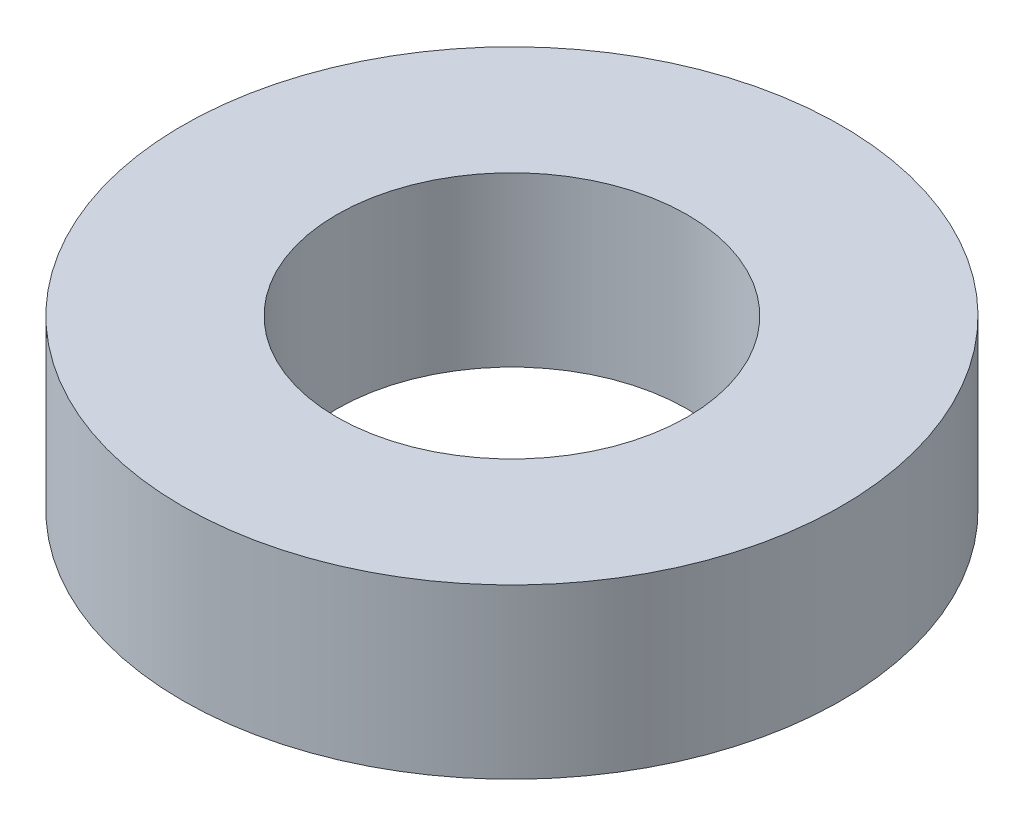
ISO-10303-21;
HEADER;
FILE_DESCRIPTION(('STEP AP214'),'2;1');
FILE_NAME('part.step','',(''),(''),'','','');
FILE_SCHEMA(('AUTOMOTIVE_DESIGN { 1 0 10303 214 1 1 1 1 }'));
ENDSEC;
DATA;
#1=APPLICATION_CONTEXT('core data for automotive mechanical design processes');
#2=APPLICATION_PROTOCOL_DEFINITION('international standard','automotive_design',2000,#1);
#3=PRODUCT_CONTEXT('',#1,'mechanical');
#4=PRODUCT('Part','Part','',(#3));
#5=PRODUCT_RELATED_PRODUCT_CATEGORY('part','',(#4));
#6=PRODUCT_DEFINITION_FORMATION('','',#4);
#7=PRODUCT_DEFINITION_CONTEXT('part definition',#1,'design');
#8=PRODUCT_DEFINITION('design','',#6,#7);
#9=PRODUCT_DEFINITION_SHAPE('','',#8);
#10=(LENGTH_UNIT() NAMED_UNIT(*) SI_UNIT(.MILLI.,.METRE.));
#11=(NAMED_UNIT(*) PLANE_ANGLE_UNIT() SI_UNIT($,.RADIAN.));
#12=(NAMED_UNIT(*) SI_UNIT($,.STERADIAN.) SOLID_ANGLE_UNIT());
#13=UNCERTAINTY_MEASURE_WITH_UNIT(LENGTH_MEASURE(1.E-05),#10,'distance_accuracy_value','');
#14=(GEOMETRIC_REPRESENTATION_CONTEXT(3) GLOBAL_UNCERTAINTY_ASSIGNED_CONTEXT((#13)) GLOBAL_UNIT_ASSIGNED_CONTEXT((#10,
#11,#12)) REPRESENTATION_CONTEXT('',''));
#15=CARTESIAN_POINT('',(0.,0.,0.));
#16=DIRECTION('',(0.,0.,1.));
#17=DIRECTION('',(1.,0.,0.));
#18=AXIS2_PLACEMENT_3D('',#15,#16,#17);
#19=CARTESIAN_POINT('',(0.,12.,0.));
#20=DIRECTION('',(0.,1.,0.));
#21=DIRECTION('',(0.,0.,1.));
#22=AXIS2_PLACEMENT_3D('',#19,#20,#21);
#23=PLANE('',#22);
#24=CARTESIAN_POINT('',(0.,12.,0.));
#25=DIRECTION('',(0.,1.,0.));
#26=DIRECTION('',(0.,0.,1.));
#27=AXIS2_PLACEMENT_3D('',#24,#25,#26);
#28=CIRCLE('',#27,23.5);
#29=CARTESIAN_POINT('',(0.,12.,23.5));
#30=VERTEX_POINT('',#29);
#31=EDGE_CURVE('E10',#30,#30,#28,.T.);
#32=ORIENTED_EDGE('',*,*,#31,.T.);
#33=EDGE_LOOP('',(#32));
#34=FACE_BOUND('',#33,.T.);
#35=CARTESIAN_POINT('',(0.,12.,0.));
#36=DIRECTION('',(0.,1.,0.));
#37=DIRECTION('',(0.,0.,1.));
#38=AXIS2_PLACEMENT_3D('',#35,#36,#37);
#39=CIRCLE('',#38,12.5);
#40=CARTESIAN_POINT('',(0.,12.,12.5));
#41=VERTEX_POINT('',#40);
#42=EDGE_CURVE('E45',#41,#41,#39,.T.);
#43=ORIENTED_EDGE('',*,*,#42,.F.);
#44=EDGE_LOOP('',(#43));
#45=FACE_BOUND('',#44,.T.);
#46=ADVANCED_FACE('F34',(#34,#45),#23,.T.);
#47=CARTESIAN_POINT('',(0.,0.,0.));
#48=DIRECTION('',(0.,1.,0.));
#49=DIRECTION('',(0.,0.,1.));
#50=AXIS2_PLACEMENT_3D('',#47,#48,#49);
#51=PLANE('',#50);
#52=CARTESIAN_POINT('',(0.,0.,0.));
#53=DIRECTION('',(0.,1.,0.));
#54=DIRECTION('',(0.,0.,1.));
#55=AXIS2_PLACEMENT_3D('',#52,#53,#54);
#56=CIRCLE('',#55,23.5);
#57=CARTESIAN_POINT('',(0.,0.,23.5));
#58=VERTEX_POINT('',#57);
#59=EDGE_CURVE('E38',#58,#58,#56,.T.);
#60=ORIENTED_EDGE('',*,*,#59,.F.);
#61=EDGE_LOOP('',(#60));
#62=FACE_BOUND('',#61,.T.);
#63=CARTESIAN_POINT('',(0.,0.,0.));
#64=DIRECTION('',(0.,1.,0.));
#65=DIRECTION('',(0.,0.,1.));
#66=AXIS2_PLACEMENT_3D('',#63,#64,#65);
#67=CIRCLE('',#66,12.5);
#68=CARTESIAN_POINT('',(0.,0.,12.5));
#69=VERTEX_POINT('',#68);
#70=EDGE_CURVE('E47',#69,#69,#67,.T.);
#71=ORIENTED_EDGE('',*,*,#70,.T.);
#72=EDGE_LOOP('',(#71));
#73=FACE_BOUND('',#72,.T.);
#74=ADVANCED_FACE('F57',(#62,#73),#51,.F.);
#75=CARTESIAN_POINT('',(0.,12.,0.));
#76=DIRECTION('',(0.,-1.,0.));
#77=DIRECTION('',(0.,0.,-1.));
#78=AXIS2_PLACEMENT_3D('',#75,#76,#77);
#79=CYLINDRICAL_SURFACE('',#78,23.5);
#80=ORIENTED_EDGE('',*,*,#31,.F.);
#81=EDGE_LOOP('',(#80));
#82=FACE_BOUND('',#81,.T.);
#83=ORIENTED_EDGE('',*,*,#59,.T.);
#84=EDGE_LOOP('',(#83));
#85=FACE_BOUND('',#84,.T.);
#86=ADVANCED_FACE('F36',(#82,#85),#79,.T.);
#87=CARTESIAN_POINT('',(0.,12.,0.));
#88=DIRECTION('',(0.,-1.,0.));
#89=DIRECTION('',(0.,0.,-1.));
#90=AXIS2_PLACEMENT_3D('',#87,#88,#89);
#91=CYLINDRICAL_SURFACE('',#90,12.5);
#92=ORIENTED_EDGE('',*,*,#42,.T.);
#93=EDGE_LOOP('',(#92));
#94=FACE_BOUND('',#93,.T.);
#95=ORIENTED_EDGE('',*,*,#70,.F.);
#96=EDGE_LOOP('',(#95));
#97=FACE_BOUND('',#96,.T.);
#98=ADVANCED_FACE('F53',(#94,#97),#91,.F.);
#99=CLOSED_SHELL('',(#46,#74,#86,#98));
#100=MANIFOLD_SOLID_BREP('B2',#99);
#101=ADVANCED_BREP_SHAPE_REPRESENTATION('',(#18,#100),#14);
#102=SHAPE_DEFINITION_REPRESENTATION(#9,#101);
ENDSEC;
END-ISO-10303-21;
